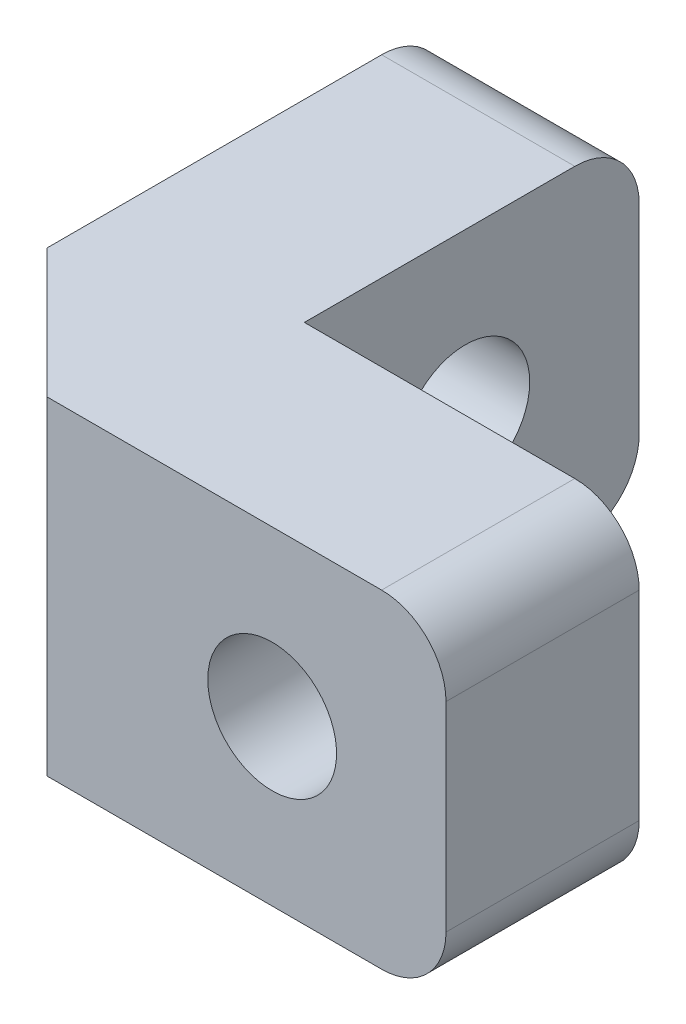
ISO-10303-21;
HEADER;
FILE_DESCRIPTION(('STEP AP214'),'2;1');
FILE_NAME('part.step','',(''),(''),'','','');
FILE_SCHEMA(('AUTOMOTIVE_DESIGN { 1 0 10303 214 1 1 1 1 }'));
ENDSEC;
DATA;
#1=APPLICATION_CONTEXT('core data for automotive mechanical design processes');
#2=APPLICATION_PROTOCOL_DEFINITION('international standard','automotive_design',2000,#1);
#3=PRODUCT_CONTEXT('',#1,'mechanical');
#4=PRODUCT('Part','Part','',(#3));
#5=PRODUCT_RELATED_PRODUCT_CATEGORY('part','',(#4));
#6=PRODUCT_DEFINITION_FORMATION('','',#4);
#7=PRODUCT_DEFINITION_CONTEXT('part definition',#1,'design');
#8=PRODUCT_DEFINITION('design','',#6,#7);
#9=PRODUCT_DEFINITION_SHAPE('','',#8);
#10=(LENGTH_UNIT() NAMED_UNIT(*) SI_UNIT(.MILLI.,.METRE.));
#11=(NAMED_UNIT(*) PLANE_ANGLE_UNIT() SI_UNIT($,.RADIAN.));
#12=(NAMED_UNIT(*) SI_UNIT($,.STERADIAN.) SOLID_ANGLE_UNIT());
#13=UNCERTAINTY_MEASURE_WITH_UNIT(LENGTH_MEASURE(1.E-05),#10,'distance_accuracy_value','');
#14=(GEOMETRIC_REPRESENTATION_CONTEXT(3) GLOBAL_UNCERTAINTY_ASSIGNED_CONTEXT((#13)) GLOBAL_UNIT_ASSIGNED_CONTEXT((#10,
#11,#12)) REPRESENTATION_CONTEXT('',''));
#15=CARTESIAN_POINT('',(0.,0.,0.));
#16=DIRECTION('',(0.,0.,1.));
#17=DIRECTION('',(1.,0.,0.));
#18=AXIS2_PLACEMENT_3D('',#15,#16,#17);
#19=CARTESIAN_POINT('',(-5.1,2.55,-2.5));
#20=DIRECTION('',(1.,0.,0.));
#21=DIRECTION('',(0.,0.,-1.));
#22=AXIS2_PLACEMENT_3D('',#19,#20,#21);
#23=CYLINDRICAL_SURFACE('',#22,1.);
#24=CARTESIAN_POINT('',(0.,2.55,-2.5));
#25=DIRECTION('',(1.,0.,0.));
#26=DIRECTION('',(0.,0.,-1.));
#27=AXIS2_PLACEMENT_3D('',#24,#25,#26);
#28=CIRCLE('',#27,1.);
#29=CARTESIAN_POINT('',(0.,2.55,-3.5));
#30=VERTEX_POINT('',#29);
#31=EDGE_CURVE('E190',#30,#30,#28,.T.);
#32=ORIENTED_EDGE('',*,*,#31,.T.);
#33=EDGE_LOOP('',(#32));
#34=FACE_BOUND('',#33,.T.);
#35=CARTESIAN_POINT('',(-1.6,2.55,-2.5));
#36=DIRECTION('',(-1.,0.,0.));
#37=DIRECTION('',(0.,0.,1.));
#38=AXIS2_PLACEMENT_3D('',#35,#36,#37);
#39=CIRCLE('',#38,1.);
#40=CARTESIAN_POINT('',(-1.6,2.55,-1.5));
#41=VERTEX_POINT('',#40);
#42=EDGE_CURVE('E36',#41,#41,#39,.F.);
#43=ORIENTED_EDGE('',*,*,#42,.F.);
#44=EDGE_LOOP('',(#43));
#45=FACE_BOUND('',#44,.T.);
#46=ADVANCED_FACE('F32',(#34,#45),#23,.F.);
#47=CARTESIAN_POINT('',(2.5,2.55,5.1));
#48=DIRECTION('',(0.,0.,-1.));
#49=DIRECTION('',(-1.,0.,0.));
#50=AXIS2_PLACEMENT_3D('',#47,#48,#49);
#51=CYLINDRICAL_SURFACE('',#50,1.);
#52=CARTESIAN_POINT('',(2.5,2.55,3.));
#53=DIRECTION('',(0.,0.,-1.));
#54=DIRECTION('',(-1.,0.,0.));
#55=AXIS2_PLACEMENT_3D('',#52,#53,#54);
#56=CIRCLE('',#55,1.);
#57=CARTESIAN_POINT('',(1.5,2.55,3.));
#58=VERTEX_POINT('',#57);
#59=EDGE_CURVE('E188',#58,#58,#56,.T.);
#60=ORIENTED_EDGE('',*,*,#59,.F.);
#61=EDGE_LOOP('',(#60));
#62=FACE_BOUND('',#61,.T.);
#63=CARTESIAN_POINT('',(2.5,2.55,1.4));
#64=DIRECTION('',(0.,0.,-1.));
#65=DIRECTION('',(-1.,0.,0.));
#66=AXIS2_PLACEMENT_3D('',#63,#64,#65);
#67=CIRCLE('',#66,1.);
#68=CARTESIAN_POINT('',(1.5,2.55,1.4));
#69=VERTEX_POINT('',#68);
#70=EDGE_CURVE('E191',#69,#69,#67,.F.);
#71=ORIENTED_EDGE('',*,*,#70,.F.);
#72=EDGE_LOOP('',(#71));
#73=FACE_BOUND('',#72,.T.);
#74=ADVANCED_FACE('F266',(#62,#73),#51,.F.);
#75=CARTESIAN_POINT('',(0.,5.1,0.));
#76=DIRECTION('',(0.,0.,1.));
#77=DIRECTION('',(1.,0.,0.));
#78=AXIS2_PLACEMENT_3D('',#75,#76,#77);
#79=PLANE('',#78);
#80=CARTESIAN_POINT('',(2.5,2.55,0.));
#81=DIRECTION('',(0.,0.,-1.));
#82=DIRECTION('',(-1.,0.,0.));
#83=AXIS2_PLACEMENT_3D('',#80,#81,#82);
#84=CIRCLE('',#83,1.7);
#85=CARTESIAN_POINT('',(0.8,2.55,0.));
#86=VERTEX_POINT('',#85);
#87=EDGE_CURVE('E197',#86,#86,#84,.T.);
#88=ORIENTED_EDGE('',*,*,#87,.F.);
#89=EDGE_LOOP('',(#88));
#90=FACE_BOUND('',#89,.T.);
#91=DIRECTION('',(0.,-1.,0.));
#92=VECTOR('',#91,1.);
#93=CARTESIAN_POINT('',(5.2,5.1,0.));
#94=LINE('',#93,#92);
#95=CARTESIAN_POINT('',(5.2,4.1,0.));
#96=VERTEX_POINT('',#95);
#97=CARTESIAN_POINT('',(5.2,1.,0.));
#98=VERTEX_POINT('',#97);
#99=EDGE_CURVE('E212',#96,#98,#94,.T.);
#100=ORIENTED_EDGE('',*,*,#99,.T.);
#101=CARTESIAN_POINT('',(4.2,1.,0.));
#102=DIRECTION('',(0.,0.,1.));
#103=DIRECTION('',(1.,0.,0.));
#104=AXIS2_PLACEMENT_3D('',#101,#102,#103);
#105=CIRCLE('',#104,1.);
#106=CARTESIAN_POINT('',(4.2,0.,0.));
#107=VERTEX_POINT('',#106);
#108=EDGE_CURVE('E166',#98,#107,#105,.F.);
#109=ORIENTED_EDGE('',*,*,#108,.T.);
#110=DIRECTION('',(-1.,0.,0.));
#111=VECTOR('',#110,1.);
#112=CARTESIAN_POINT('',(0.,0.,0.));
#113=LINE('',#112,#111);
#114=CARTESIAN_POINT('',(0.,0.,0.));
#115=VERTEX_POINT('',#114);
#116=EDGE_CURVE('E140',#107,#115,#113,.T.);
#117=ORIENTED_EDGE('',*,*,#116,.T.);
#118=DIRECTION('',(0.,-1.,0.));
#119=VECTOR('',#118,1.);
#120=CARTESIAN_POINT('',(0.,5.1,0.));
#121=LINE('',#120,#119);
#122=CARTESIAN_POINT('',(0.,5.1,0.));
#123=VERTEX_POINT('',#122);
#124=EDGE_CURVE('E133',#123,#115,#121,.T.);
#125=ORIENTED_EDGE('',*,*,#124,.F.);
#126=DIRECTION('',(-1.,0.,0.));
#127=VECTOR('',#126,1.);
#128=CARTESIAN_POINT('',(0.,5.1,0.));
#129=LINE('',#128,#127);
#130=CARTESIAN_POINT('',(4.2,5.1,0.));
#131=VERTEX_POINT('',#130);
#132=EDGE_CURVE('E118',#131,#123,#129,.T.);
#133=ORIENTED_EDGE('',*,*,#132,.F.);
#134=CARTESIAN_POINT('',(4.2,4.1,0.));
#135=DIRECTION('',(0.,0.,1.));
#136=DIRECTION('',(1.,0.,0.));
#137=AXIS2_PLACEMENT_3D('',#134,#135,#136);
#138=CIRCLE('',#137,1.);
#139=EDGE_CURVE('E164',#131,#96,#138,.F.);
#140=ORIENTED_EDGE('',*,*,#139,.T.);
#141=EDGE_LOOP('',(#100,#109,#117,#125,#133,#140));
#142=FACE_BOUND('',#141,.T.);
#143=ADVANCED_FACE('F138',(#90,#142),#79,.F.);
#144=CARTESIAN_POINT('',(0.,5.1,0.));
#145=DIRECTION('',(-1.,0.,0.));
#146=DIRECTION('',(0.,0.,1.));
#147=AXIS2_PLACEMENT_3D('',#144,#145,#146);
#148=PLANE('',#147);
#149=ORIENTED_EDGE('',*,*,#31,.F.);
#150=EDGE_LOOP('',(#149));
#151=FACE_BOUND('',#150,.T.);
#152=DIRECTION('',(0.,0.,-1.));
#153=VECTOR('',#152,1.);
#154=CARTESIAN_POINT('',(0.,0.,0.));
#155=LINE('',#154,#153);
#156=CARTESIAN_POINT('',(0.,0.,-4.2));
#157=VERTEX_POINT('',#156);
#158=EDGE_CURVE('E214',#115,#157,#155,.T.);
#159=ORIENTED_EDGE('',*,*,#158,.T.);
#160=CARTESIAN_POINT('',(0.,1.,-4.2));
#161=DIRECTION('',(-1.,0.,0.));
#162=DIRECTION('',(0.,0.,1.));
#163=AXIS2_PLACEMENT_3D('',#160,#161,#162);
#164=CIRCLE('',#163,1.);
#165=CARTESIAN_POINT('',(0.,1.,-5.2));
#166=VERTEX_POINT('',#165);
#167=EDGE_CURVE('E11',#157,#166,#164,.F.);
#168=ORIENTED_EDGE('',*,*,#167,.T.);
#169=DIRECTION('',(0.,-1.,0.));
#170=VECTOR('',#169,1.);
#171=CARTESIAN_POINT('',(0.,5.1,-5.2));
#172=LINE('',#171,#170);
#173=CARTESIAN_POINT('',(0.,4.1,-5.2));
#174=VERTEX_POINT('',#173);
#175=EDGE_CURVE('E143',#174,#166,#172,.T.);
#176=ORIENTED_EDGE('',*,*,#175,.F.);
#177=CARTESIAN_POINT('',(0.,4.1,-4.2));
#178=DIRECTION('',(-1.,0.,0.));
#179=DIRECTION('',(0.,0.,1.));
#180=AXIS2_PLACEMENT_3D('',#177,#178,#179);
#181=CIRCLE('',#180,1.);
#182=CARTESIAN_POINT('',(0.,5.1,-4.2));
#183=VERTEX_POINT('',#182);
#184=EDGE_CURVE('E41',#174,#183,#181,.F.);
#185=ORIENTED_EDGE('',*,*,#184,.T.);
#186=DIRECTION('',(0.,0.,-1.));
#187=VECTOR('',#186,1.);
#188=CARTESIAN_POINT('',(0.,5.1,0.));
#189=LINE('',#188,#187);
#190=EDGE_CURVE('E123',#123,#183,#189,.T.);
#191=ORIENTED_EDGE('',*,*,#190,.F.);
#192=ORIENTED_EDGE('',*,*,#124,.T.);
#193=EDGE_LOOP('',(#159,#168,#176,#185,#191,#192));
#194=FACE_BOUND('',#193,.T.);
#195=ADVANCED_FACE('F132',(#151,#194),#148,.F.);
#196=CARTESIAN_POINT('',(0.,5.1,-5.2));
#197=DIRECTION('',(0.,0.,1.));
#198=DIRECTION('',(1.,0.,0.));
#199=AXIS2_PLACEMENT_3D('',#196,#197,#198);
#200=PLANE('',#199);
#201=ORIENTED_EDGE('',*,*,#175,.T.);
#202=DIRECTION('',(-1.,0.,0.));
#203=VECTOR('',#202,1.);
#204=CARTESIAN_POINT('',(0.,1.,-5.2));
#205=LINE('',#204,#203);
#206=CARTESIAN_POINT('',(-3.,1.,-5.2));
#207=VERTEX_POINT('',#206);
#208=EDGE_CURVE('E180',#166,#207,#205,.T.);
#209=ORIENTED_EDGE('',*,*,#208,.T.);
#210=DIRECTION('',(0.,-1.,0.));
#211=VECTOR('',#210,1.);
#212=CARTESIAN_POINT('',(-3.,5.1,-5.2));
#213=LINE('',#212,#211);
#214=CARTESIAN_POINT('',(-3.,4.1,-5.2));
#215=VERTEX_POINT('',#214);
#216=EDGE_CURVE('E148',#215,#207,#213,.T.);
#217=ORIENTED_EDGE('',*,*,#216,.F.);
#218=DIRECTION('',(-1.,0.,0.));
#219=VECTOR('',#218,1.);
#220=CARTESIAN_POINT('',(0.,4.1,-5.2));
#221=LINE('',#220,#219);
#222=EDGE_CURVE('E54',#215,#174,#221,.F.);
#223=ORIENTED_EDGE('',*,*,#222,.T.);
#224=EDGE_LOOP('',(#201,#209,#217,#223));
#225=FACE_BOUND('',#224,.T.);
#226=ADVANCED_FACE('F228',(#225),#200,.F.);
#227=CARTESIAN_POINT('',(-3.,5.1,-5.2));
#228=DIRECTION('',(1.,0.,0.));
#229=DIRECTION('',(0.,0.,-1.));
#230=AXIS2_PLACEMENT_3D('',#227,#228,#229);
#231=PLANE('',#230);
#232=CARTESIAN_POINT('',(-3.,2.55,-2.5));
#233=DIRECTION('',(-1.,0.,0.));
#234=DIRECTION('',(0.,0.,1.));
#235=AXIS2_PLACEMENT_3D('',#232,#233,#234);
#236=CIRCLE('',#235,1.7);
#237=CARTESIAN_POINT('',(-3.,2.55,-0.8));
#238=VERTEX_POINT('',#237);
#239=EDGE_CURVE('E204',#238,#238,#236,.T.);
#240=ORIENTED_EDGE('',*,*,#239,.F.);
#241=EDGE_LOOP('',(#240));
#242=FACE_BOUND('',#241,.T.);
#243=ORIENTED_EDGE('',*,*,#216,.T.);
#244=CARTESIAN_POINT('',(-3.,1.,-4.2));
#245=DIRECTION('',(1.,0.,0.));
#246=DIRECTION('',(0.,0.,-1.));
#247=AXIS2_PLACEMENT_3D('',#244,#245,#246);
#248=CIRCLE('',#247,1.);
#249=CARTESIAN_POINT('',(-3.,0.,-4.2));
#250=VERTEX_POINT('',#249);
#251=EDGE_CURVE('E185',#207,#250,#248,.F.);
#252=ORIENTED_EDGE('',*,*,#251,.T.);
#253=DIRECTION('',(0.,0.,1.));
#254=VECTOR('',#253,1.);
#255=CARTESIAN_POINT('',(-3.,0.,-5.2));
#256=LINE('',#255,#254);
#257=CARTESIAN_POINT('',(-3.,0.,0.999999999999991));
#258=VERTEX_POINT('',#257);
#259=EDGE_CURVE('E216',#250,#258,#256,.T.);
#260=ORIENTED_EDGE('',*,*,#259,.T.);
#261=DIRECTION('',(0.,1.,0.));
#262=VECTOR('',#261,1.);
#263=CARTESIAN_POINT('',(-3.,5.1,0.999999999999991));
#264=LINE('',#263,#262);
#265=CARTESIAN_POINT('',(-3.,5.1,0.99999999999999));
#266=VERTEX_POINT('',#265);
#267=EDGE_CURVE('E154',#258,#266,#264,.T.);
#268=ORIENTED_EDGE('',*,*,#267,.T.);
#269=DIRECTION('',(0.,0.,1.));
#270=VECTOR('',#269,1.);
#271=CARTESIAN_POINT('',(-3.,5.1,-5.2));
#272=LINE('',#271,#270);
#273=CARTESIAN_POINT('',(-3.,5.1,-4.2));
#274=VERTEX_POINT('',#273);
#275=EDGE_CURVE('E135',#274,#266,#272,.T.);
#276=ORIENTED_EDGE('',*,*,#275,.F.);
#277=CARTESIAN_POINT('',(-3.,4.1,-4.2));
#278=DIRECTION('',(1.,0.,0.));
#279=DIRECTION('',(0.,0.,-1.));
#280=AXIS2_PLACEMENT_3D('',#277,#278,#279);
#281=CIRCLE('',#280,1.);
#282=EDGE_CURVE('E183',#274,#215,#281,.F.);
#283=ORIENTED_EDGE('',*,*,#282,.T.);
#284=EDGE_LOOP('',(#243,#252,#260,#268,#276,#283));
#285=FACE_BOUND('',#284,.T.);
#286=ADVANCED_FACE('F225',(#242,#285),#231,.F.);
#287=CARTESIAN_POINT('',(-3.,5.1,3.));
#288=DIRECTION('',(0.,0.,-1.));
#289=DIRECTION('',(-1.,0.,0.));
#290=AXIS2_PLACEMENT_3D('',#287,#288,#289);
#291=PLANE('',#290);
#292=ORIENTED_EDGE('',*,*,#59,.T.);
#293=EDGE_LOOP('',(#292));
#294=FACE_BOUND('',#293,.T.);
#295=DIRECTION('',(1.,0.,0.));
#296=VECTOR('',#295,1.);
#297=CARTESIAN_POINT('',(-3.,0.,3.));
#298=LINE('',#297,#296);
#299=CARTESIAN_POINT('',(-0.999999999999998,0.,3.));
#300=VERTEX_POINT('',#299);
#301=CARTESIAN_POINT('',(4.2,0.,3.));
#302=VERTEX_POINT('',#301);
#303=EDGE_CURVE('E129',#300,#302,#298,.T.);
#304=ORIENTED_EDGE('',*,*,#303,.T.);
#305=CARTESIAN_POINT('',(4.2,1.,3.));
#306=DIRECTION('',(0.,0.,-1.));
#307=DIRECTION('',(-1.,0.,0.));
#308=AXIS2_PLACEMENT_3D('',#305,#306,#307);
#309=CIRCLE('',#308,1.);
#310=CARTESIAN_POINT('',(5.2,1.,3.));
#311=VERTEX_POINT('',#310);
#312=EDGE_CURVE('E174',#302,#311,#309,.F.);
#313=ORIENTED_EDGE('',*,*,#312,.T.);
#314=DIRECTION('',(0.,-1.,0.));
#315=VECTOR('',#314,1.);
#316=CARTESIAN_POINT('',(5.2,5.1,3.));
#317=LINE('',#316,#315);
#318=CARTESIAN_POINT('',(5.2,4.1,3.));
#319=VERTEX_POINT('',#318);
#320=EDGE_CURVE('E221',#319,#311,#317,.T.);
#321=ORIENTED_EDGE('',*,*,#320,.F.);
#322=CARTESIAN_POINT('',(4.2,4.1,3.));
#323=DIRECTION('',(0.,0.,-1.));
#324=DIRECTION('',(-1.,0.,0.));
#325=AXIS2_PLACEMENT_3D('',#322,#323,#324);
#326=CIRCLE('',#325,1.);
#327=CARTESIAN_POINT('',(4.2,5.1,3.));
#328=VERTEX_POINT('',#327);
#329=EDGE_CURVE('E172',#319,#328,#326,.F.);
#330=ORIENTED_EDGE('',*,*,#329,.T.);
#331=DIRECTION('',(1.,0.,0.));
#332=VECTOR('',#331,1.);
#333=CARTESIAN_POINT('',(-3.,5.1,3.));
#334=LINE('',#333,#332);
#335=CARTESIAN_POINT('',(-0.999999999999998,5.1,3.));
#336=VERTEX_POINT('',#335);
#337=EDGE_CURVE('E210',#336,#328,#334,.T.);
#338=ORIENTED_EDGE('',*,*,#337,.F.);
#339=DIRECTION('',(0.,-1.,0.));
#340=VECTOR('',#339,1.);
#341=CARTESIAN_POINT('',(-0.999999999999998,5.1,3.));
#342=LINE('',#341,#340);
#343=EDGE_CURVE('E142',#336,#300,#342,.T.);
#344=ORIENTED_EDGE('',*,*,#343,.T.);
#345=EDGE_LOOP('',(#304,#313,#321,#330,#338,#344));
#346=FACE_BOUND('',#345,.T.);
#347=ADVANCED_FACE('F238',(#294,#346),#291,.F.);
#348=CARTESIAN_POINT('',(5.2,5.1,3.));
#349=DIRECTION('',(-1.,0.,0.));
#350=DIRECTION('',(0.,0.,1.));
#351=AXIS2_PLACEMENT_3D('',#348,#349,#350);
#352=PLANE('',#351);
#353=ORIENTED_EDGE('',*,*,#320,.T.);
#354=DIRECTION('',(0.,0.,-1.));
#355=VECTOR('',#354,1.);
#356=CARTESIAN_POINT('',(5.2,1.,3.));
#357=LINE('',#356,#355);
#358=EDGE_CURVE('E161',#311,#98,#357,.T.);
#359=ORIENTED_EDGE('',*,*,#358,.T.);
#360=ORIENTED_EDGE('',*,*,#99,.F.);
#361=DIRECTION('',(0.,0.,-1.));
#362=VECTOR('',#361,1.);
#363=CARTESIAN_POINT('',(5.2,4.1,3.));
#364=LINE('',#363,#362);
#365=EDGE_CURVE('E159',#96,#319,#364,.F.);
#366=ORIENTED_EDGE('',*,*,#365,.T.);
#367=EDGE_LOOP('',(#353,#359,#360,#366));
#368=FACE_BOUND('',#367,.T.);
#369=ADVANCED_FACE('F247',(#368),#352,.F.);
#370=CARTESIAN_POINT('',(0.,5.1,0.));
#371=DIRECTION('',(0.,1.,0.));
#372=DIRECTION('',(0.,0.,1.));
#373=AXIS2_PLACEMENT_3D('',#370,#371,#372);
#374=PLANE('',#373);
#375=ORIENTED_EDGE('',*,*,#337,.T.);
#376=DIRECTION('',(0.,0.,-1.));
#377=VECTOR('',#376,1.);
#378=CARTESIAN_POINT('',(4.2,5.1,0.));
#379=LINE('',#378,#377);
#380=EDGE_CURVE('E126',#328,#131,#379,.T.);
#381=ORIENTED_EDGE('',*,*,#380,.T.);
#382=ORIENTED_EDGE('',*,*,#132,.T.);
#383=ORIENTED_EDGE('',*,*,#190,.T.);
#384=DIRECTION('',(-1.,0.,0.));
#385=VECTOR('',#384,1.);
#386=CARTESIAN_POINT('',(-3.,5.1,-4.2));
#387=LINE('',#386,#385);
#388=EDGE_CURVE('E176',#183,#274,#387,.T.);
#389=ORIENTED_EDGE('',*,*,#388,.T.);
#390=ORIENTED_EDGE('',*,*,#275,.T.);
#391=DIRECTION('',(-0.707106781186546,0.,-0.707106781186549));
#392=VECTOR('',#391,1.);
#393=CARTESIAN_POINT('',(-2.,5.1,1.99999999999999));
#394=LINE('',#393,#392);
#395=EDGE_CURVE('E157',#266,#336,#394,.F.);
#396=ORIENTED_EDGE('',*,*,#395,.T.);
#397=EDGE_LOOP('',(#375,#381,#382,#383,#389,#390,#396));
#398=FACE_BOUND('',#397,.T.);
#399=ADVANCED_FACE('F121',(#398),#374,.T.);
#400=CARTESIAN_POINT('',(0.,0.,0.));
#401=DIRECTION('',(0.,1.,0.));
#402=DIRECTION('',(0.,0.,1.));
#403=AXIS2_PLACEMENT_3D('',#400,#401,#402);
#404=PLANE('',#403);
#405=ORIENTED_EDGE('',*,*,#116,.F.);
#406=DIRECTION('',(0.,0.,-1.));
#407=VECTOR('',#406,1.);
#408=CARTESIAN_POINT('',(4.2,0.,0.));
#409=LINE('',#408,#407);
#410=EDGE_CURVE('E170',#107,#302,#409,.F.);
#411=ORIENTED_EDGE('',*,*,#410,.T.);
#412=ORIENTED_EDGE('',*,*,#303,.F.);
#413=DIRECTION('',(0.707106781186546,0.,0.707106781186549));
#414=VECTOR('',#413,1.);
#415=CARTESIAN_POINT('',(-0.999999999999998,0.,3.));
#416=LINE('',#415,#414);
#417=EDGE_CURVE('E146',#300,#258,#416,.F.);
#418=ORIENTED_EDGE('',*,*,#417,.T.);
#419=ORIENTED_EDGE('',*,*,#259,.F.);
#420=DIRECTION('',(-1.,0.,0.));
#421=VECTOR('',#420,1.);
#422=CARTESIAN_POINT('',(0.,0.,-4.2));
#423=LINE('',#422,#421);
#424=EDGE_CURVE('E168',#250,#157,#423,.F.);
#425=ORIENTED_EDGE('',*,*,#424,.T.);
#426=ORIENTED_EDGE('',*,*,#158,.F.);
#427=EDGE_LOOP('',(#405,#411,#412,#418,#419,#425,#426));
#428=FACE_BOUND('',#427,.T.);
#429=ADVANCED_FACE('F254',(#428),#404,.F.);
#430=CARTESIAN_POINT('',(-0.999999999999998,5.1,3.));
#431=DIRECTION('',(0.707106781186549,0.,-0.707106781186546));
#432=DIRECTION('',(0.,-1.,0.));
#433=AXIS2_PLACEMENT_3D('',#430,#431,#432);
#434=PLANE('',#433);
#435=ORIENTED_EDGE('',*,*,#395,.F.);
#436=ORIENTED_EDGE('',*,*,#267,.F.);
#437=ORIENTED_EDGE('',*,*,#417,.F.);
#438=ORIENTED_EDGE('',*,*,#343,.F.);
#439=EDGE_LOOP('',(#435,#436,#437,#438));
#440=FACE_BOUND('',#439,.T.);
#441=ADVANCED_FACE('F235',(#440),#434,.F.);
#442=CARTESIAN_POINT('',(4.2,1.,3.));
#443=DIRECTION('',(0.,0.,-1.));
#444=DIRECTION('',(-1.,0.,0.));
#445=AXIS2_PLACEMENT_3D('',#442,#443,#444);
#446=CYLINDRICAL_SURFACE('',#445,1.);
#447=ORIENTED_EDGE('',*,*,#312,.F.);
#448=ORIENTED_EDGE('',*,*,#410,.F.);
#449=ORIENTED_EDGE('',*,*,#108,.F.);
#450=ORIENTED_EDGE('',*,*,#358,.F.);
#451=EDGE_LOOP('',(#447,#448,#449,#450));
#452=FACE_BOUND('',#451,.T.);
#453=ADVANCED_FACE('F251',(#452),#446,.T.);
#454=CARTESIAN_POINT('',(4.2,4.1,0.));
#455=DIRECTION('',(0.,0.,1.));
#456=DIRECTION('',(1.,0.,0.));
#457=AXIS2_PLACEMENT_3D('',#454,#455,#456);
#458=CYLINDRICAL_SURFACE('',#457,1.);
#459=ORIENTED_EDGE('',*,*,#329,.F.);
#460=ORIENTED_EDGE('',*,*,#365,.F.);
#461=ORIENTED_EDGE('',*,*,#139,.F.);
#462=ORIENTED_EDGE('',*,*,#380,.F.);
#463=EDGE_LOOP('',(#459,#460,#461,#462));
#464=FACE_BOUND('',#463,.T.);
#465=ADVANCED_FACE('F244',(#464),#458,.T.);
#466=CARTESIAN_POINT('',(0.,1.,-4.2));
#467=DIRECTION('',(-1.,0.,0.));
#468=DIRECTION('',(0.,0.,1.));
#469=AXIS2_PLACEMENT_3D('',#466,#467,#468);
#470=CYLINDRICAL_SURFACE('',#469,1.);
#471=ORIENTED_EDGE('',*,*,#167,.F.);
#472=ORIENTED_EDGE('',*,*,#424,.F.);
#473=ORIENTED_EDGE('',*,*,#251,.F.);
#474=ORIENTED_EDGE('',*,*,#208,.F.);
#475=EDGE_LOOP('',(#471,#472,#473,#474));
#476=FACE_BOUND('',#475,.T.);
#477=ADVANCED_FACE('F257',(#476),#470,.T.);
#478=CARTESIAN_POINT('',(0.,4.1,-4.2));
#479=DIRECTION('',(1.,0.,0.));
#480=DIRECTION('',(0.,0.,-1.));
#481=AXIS2_PLACEMENT_3D('',#478,#479,#480);
#482=CYLINDRICAL_SURFACE('',#481,1.);
#483=ORIENTED_EDGE('',*,*,#184,.F.);
#484=ORIENTED_EDGE('',*,*,#222,.F.);
#485=ORIENTED_EDGE('',*,*,#282,.F.);
#486=ORIENTED_EDGE('',*,*,#388,.F.);
#487=EDGE_LOOP('',(#483,#484,#485,#486));
#488=FACE_BOUND('',#487,.T.);
#489=ADVANCED_FACE('F34',(#488),#482,.T.);
#490=CARTESIAN_POINT('',(2.5,2.55,1.4));
#491=DIRECTION('',(0.,0.,-1.));
#492=DIRECTION('',(-1.,0.,0.));
#493=AXIS2_PLACEMENT_3D('',#490,#491,#492);
#494=PLANE('',#493);
#495=CARTESIAN_POINT('',(2.5,2.55,1.4));
#496=DIRECTION('',(0.,0.,-1.));
#497=DIRECTION('',(-1.,0.,0.));
#498=AXIS2_PLACEMENT_3D('',#495,#496,#497);
#499=CIRCLE('',#498,1.7);
#500=CARTESIAN_POINT('',(0.8,2.55,1.4));
#501=VERTEX_POINT('',#500);
#502=EDGE_CURVE('E193',#501,#501,#499,.T.);
#503=ORIENTED_EDGE('',*,*,#502,.T.);
#504=EDGE_LOOP('',(#503));
#505=FACE_BOUND('',#504,.T.);
#506=ORIENTED_EDGE('',*,*,#70,.T.);
#507=EDGE_LOOP('',(#506));
#508=FACE_BOUND('',#507,.T.);
#509=ADVANCED_FACE('F263',(#505,#508),#494,.T.);
#510=CARTESIAN_POINT('',(2.5,2.55,1.4));
#511=DIRECTION('',(0.,0.,-1.));
#512=DIRECTION('',(-1.,0.,0.));
#513=AXIS2_PLACEMENT_3D('',#510,#511,#512);
#514=CYLINDRICAL_SURFACE('',#513,1.7);
#515=ORIENTED_EDGE('',*,*,#502,.F.);
#516=EDGE_LOOP('',(#515));
#517=FACE_BOUND('',#516,.T.);
#518=ORIENTED_EDGE('',*,*,#87,.T.);
#519=EDGE_LOOP('',(#518));
#520=FACE_BOUND('',#519,.T.);
#521=ADVANCED_FACE('F355',(#517,#520),#514,.F.);
#522=CARTESIAN_POINT('',(-1.6,2.55,-2.5));
#523=DIRECTION('',(-1.,0.,0.));
#524=DIRECTION('',(0.,0.,1.));
#525=AXIS2_PLACEMENT_3D('',#522,#523,#524);
#526=PLANE('',#525);
#527=CARTESIAN_POINT('',(-1.6,2.55,-2.5));
#528=DIRECTION('',(-1.,0.,0.));
#529=DIRECTION('',(0.,0.,1.));
#530=AXIS2_PLACEMENT_3D('',#527,#528,#529);
#531=CIRCLE('',#530,1.7);
#532=CARTESIAN_POINT('',(-1.6,2.55,-0.8));
#533=VERTEX_POINT('',#532);
#534=EDGE_CURVE('E399',#533,#533,#531,.T.);
#535=ORIENTED_EDGE('',*,*,#534,.T.);
#536=EDGE_LOOP('',(#535));
#537=FACE_BOUND('',#536,.T.);
#538=ORIENTED_EDGE('',*,*,#42,.T.);
#539=EDGE_LOOP('',(#538));
#540=FACE_BOUND('',#539,.T.);
#541=ADVANCED_FACE('F363',(#537,#540),#526,.T.);
#542=CARTESIAN_POINT('',(-1.6,2.55,-2.5));
#543=DIRECTION('',(-1.,0.,0.));
#544=DIRECTION('',(0.,0.,1.));
#545=AXIS2_PLACEMENT_3D('',#542,#543,#544);
#546=CYLINDRICAL_SURFACE('',#545,1.7);
#547=ORIENTED_EDGE('',*,*,#534,.F.);
#548=EDGE_LOOP('',(#547));
#549=FACE_BOUND('',#548,.T.);
#550=ORIENTED_EDGE('',*,*,#239,.T.);
#551=EDGE_LOOP('',(#550));
#552=FACE_BOUND('',#551,.T.);
#553=ADVANCED_FACE('F382',(#549,#552),#546,.F.);
#554=CLOSED_SHELL('',(#46,#74,#143,#195,#226,#286,#347,#369,#399,#429,#441,#453,#465,#477,#489,
#509,#521,#541,#553));
#555=MANIFOLD_SOLID_BREP('B2',#554);
#556=ADVANCED_BREP_SHAPE_REPRESENTATION('',(#18,#555),#14);
#557=SHAPE_DEFINITION_REPRESENTATION(#9,#556);
ENDSEC;
END-ISO-10303-21;
